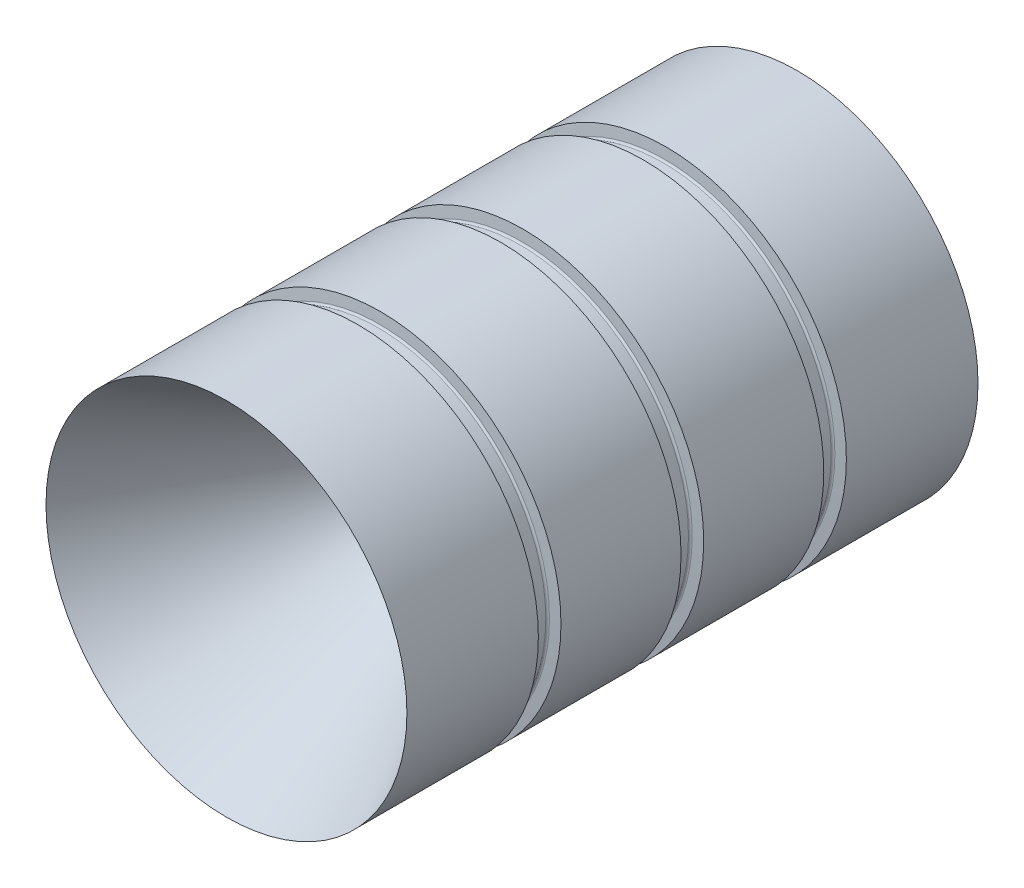
ISO-10303-21;
HEADER;
FILE_DESCRIPTION(('STEP AP214'),'2;1');
FILE_NAME('part.step','',(''),(''),'','','');
FILE_SCHEMA(('AUTOMOTIVE_DESIGN { 1 0 10303 214 1 1 1 1 }'));
ENDSEC;
DATA;
#1=APPLICATION_CONTEXT('core data for automotive mechanical design processes');
#2=APPLICATION_PROTOCOL_DEFINITION('international standard','automotive_design',2000,#1);
#3=PRODUCT_CONTEXT('',#1,'mechanical');
#4=PRODUCT('Part','Part','',(#3));
#5=PRODUCT_RELATED_PRODUCT_CATEGORY('part','',(#4));
#6=PRODUCT_DEFINITION_FORMATION('','',#4);
#7=PRODUCT_DEFINITION_CONTEXT('part definition',#1,'design');
#8=PRODUCT_DEFINITION('design','',#6,#7);
#9=PRODUCT_DEFINITION_SHAPE('','',#8);
#10=(LENGTH_UNIT() NAMED_UNIT(*) SI_UNIT(.MILLI.,.METRE.));
#11=(NAMED_UNIT(*) PLANE_ANGLE_UNIT() SI_UNIT($,.RADIAN.));
#12=(NAMED_UNIT(*) SI_UNIT($,.STERADIAN.) SOLID_ANGLE_UNIT());
#13=UNCERTAINTY_MEASURE_WITH_UNIT(LENGTH_MEASURE(1.E-05),#10,'distance_accuracy_value','');
#14=(GEOMETRIC_REPRESENTATION_CONTEXT(3) GLOBAL_UNCERTAINTY_ASSIGNED_CONTEXT((#13)) GLOBAL_UNIT_ASSIGNED_CONTEXT((#10,
#11,#12)) REPRESENTATION_CONTEXT('',''));
#15=CARTESIAN_POINT('',(0.,0.,0.));
#16=DIRECTION('',(0.,0.,1.));
#17=DIRECTION('',(1.,0.,0.));
#18=AXIS2_PLACEMENT_3D('',#15,#16,#17);
#19=CARTESIAN_POINT('',(0.,0.,0.));
#20=DIRECTION('',(0.,0.,1.));
#21=DIRECTION('',(1.,0.,0.));
#22=AXIS2_PLACEMENT_3D('',#19,#20,#21);
#23=CYLINDRICAL_SURFACE('',#22,41.2749999999944);
#24=CARTESIAN_POINT('',(0.,0.,-359.350121354874));
#25=DIRECTION('',(0.,0.,1.));
#26=DIRECTION('',(1.,0.,0.));
#27=AXIS2_PLACEMENT_3D('',#24,#25,#26);
#28=CIRCLE('',#27,41.2749999999944);
#29=CARTESIAN_POINT('',(41.2749999999944,0.,-359.350121354874));
#30=VERTEX_POINT('',#29);
#31=EDGE_CURVE('E39',#30,#30,#28,.T.);
#32=ORIENTED_EDGE('',*,*,#31,.T.);
#33=EDGE_LOOP('',(#32));
#34=FACE_BOUND('',#33,.T.);
#35=CARTESIAN_POINT('',(0.,0.,-331.883253757861));
#36=DIRECTION('',(0.,0.,-1.));
#37=DIRECTION('',(-1.,0.,0.));
#38=AXIS2_PLACEMENT_3D('',#35,#36,#37);
#39=CIRCLE('',#38,41.2749999999944);
#40=CARTESIAN_POINT('',(-41.2749999999944,0.,-331.883253757861));
#41=VERTEX_POINT('',#40);
#42=EDGE_CURVE('E60',#41,#41,#39,.T.);
#43=ORIENTED_EDGE('',*,*,#42,.T.);
#44=EDGE_LOOP('',(#43));
#45=FACE_BOUND('',#44,.T.);
#46=ADVANCED_FACE('F35',(#34,#45),#23,.T.);
#47=CARTESIAN_POINT('',(0.,0.,-326.711121354874));
#48=DIRECTION('',(0.,0.,1.));
#49=DIRECTION('',(1.,0.,0.));
#50=AXIS2_PLACEMENT_3D('',#47,#48,#49);
#51=CIRCLE('',#50,41.2749999999944);
#52=CARTESIAN_POINT('',(41.2749999999944,0.,-326.711121354874));
#53=VERTEX_POINT('',#52);
#54=EDGE_CURVE('E63',#53,#53,#51,.T.);
#55=ORIENTED_EDGE('',*,*,#54,.T.);
#56=EDGE_LOOP('',(#55));
#57=FACE_BOUND('',#56,.T.);
#58=CARTESIAN_POINT('',(0.,0.,-299.244253757861));
#59=DIRECTION('',(0.,0.,-1.));
#60=DIRECTION('',(-1.,0.,0.));
#61=AXIS2_PLACEMENT_3D('',#58,#59,#60);
#62=CIRCLE('',#61,41.2749999999944);
#63=CARTESIAN_POINT('',(-41.2749999999944,0.,-299.244253757861));
#64=VERTEX_POINT('',#63);
#65=EDGE_CURVE('E52',#64,#64,#62,.T.);
#66=ORIENTED_EDGE('',*,*,#65,.T.);
#67=EDGE_LOOP('',(#66));
#68=FACE_BOUND('',#67,.T.);
#69=ADVANCED_FACE('F196',(#57,#68),#23,.T.);
#70=CARTESIAN_POINT('',(0.,0.,-294.072121354874));
#71=DIRECTION('',(0.,0.,1.));
#72=DIRECTION('',(1.,0.,0.));
#73=AXIS2_PLACEMENT_3D('',#70,#71,#72);
#74=CIRCLE('',#73,41.2749999999944);
#75=CARTESIAN_POINT('',(41.2749999999944,0.,-294.072121354874));
#76=VERTEX_POINT('',#75);
#77=EDGE_CURVE('E55',#76,#76,#74,.T.);
#78=ORIENTED_EDGE('',*,*,#77,.T.);
#79=EDGE_LOOP('',(#78));
#80=FACE_BOUND('',#79,.T.);
#81=CARTESIAN_POINT('',(0.,0.,-264.00861575334));
#82=DIRECTION('',(0.,0.,1.));
#83=DIRECTION('',(1.,0.,0.));
#84=AXIS2_PLACEMENT_3D('',#81,#82,#83);
#85=CIRCLE('',#84,41.2749999999944);
#86=CARTESIAN_POINT('',(41.2749999999944,0.,-264.00861575334));
#87=VERTEX_POINT('',#86);
#88=EDGE_CURVE('E224',#87,#87,#85,.T.);
#89=ORIENTED_EDGE('',*,*,#88,.F.);
#90=EDGE_LOOP('',(#89));
#91=FACE_BOUND('',#90,.T.);
#92=ADVANCED_FACE('F124',(#80,#91),#23,.T.);
#93=CARTESIAN_POINT('',(0.,0.,-315.190684557908));
#94=DIRECTION('',(0.,0.,1.));
#95=DIRECTION('',(1.,0.,0.));
#96=AXIS2_PLACEMENT_3D('',#93,#94,#95);
#97=TOROIDAL_SURFACE('',#96,21.1003335883214,5.83236346593395);
#98=CARTESIAN_POINT('',(0.,0.,-317.157047262264));
#99=DIRECTION('',(0.,0.,1.));
#100=DIRECTION('',(1.,0.,0.));
#101=AXIS2_PLACEMENT_3D('',#98,#99,#100);
#102=CIRCLE('',#101,15.6094428305591);
#103=CARTESIAN_POINT('',(15.6094428305591,0.,-317.157047262264));
#104=VERTEX_POINT('',#103);
#105=EDGE_CURVE('E10',#104,#104,#102,.T.);
#106=ORIENTED_EDGE('',*,*,#105,.F.);
#107=EDGE_LOOP('',(#106));
#108=FACE_BOUND('',#107,.T.);
#109=CARTESIAN_POINT('',(0.,0.,-315.190684557908));
#110=DIRECTION('',(0.,0.,1.));
#111=DIRECTION('',(1.,0.,0.));
#112=AXIS2_PLACEMENT_3D('',#109,#110,#111);
#113=CIRCLE('',#112,15.2679701223874);
#114=CARTESIAN_POINT('',(15.2679701223874,0.,-315.190684557908));
#115=VERTEX_POINT('',#114);
#116=EDGE_CURVE('E59',#115,#115,#113,.T.);
#117=ORIENTED_EDGE('',*,*,#116,.T.);
#118=EDGE_LOOP('',(#117));
#119=FACE_BOUND('',#118,.T.);
#120=ADVANCED_FACE('F37',(#108,#119),#97,.T.);
#121=CARTESIAN_POINT('',(0.,15.6094365633116,-317.157029761452));
#122=CARTESIAN_POINT('',(0.,28.8929861971551,-354.250329010534));
#123=CARTESIAN_POINT('',(0.,34.5678059408336,-394.629031500049));
#124=B_SPLINE_CURVE_WITH_KNOTS('',2,(#121,#122,#123),.UNSPECIFIED.,.F.,.F.,(3,3),(0.,1.),.UNSPECIFIED.);
#125=CARTESIAN_POINT('',(0.,0.,0.));
#126=DIRECTION('',(0.,0.,1.));
#127=AXIS1_PLACEMENT('',#125,#126);
#128=SURFACE_OF_REVOLUTION('',#124,#127);
#129=CARTESIAN_POINT('',(0.,0.,-394.629031500049));
#130=DIRECTION('',(0.,0.,1.));
#131=DIRECTION('',(1.,0.,0.));
#132=AXIS2_PLACEMENT_3D('',#129,#130,#131);
#133=CIRCLE('',#132,34.5678059408336);
#134=CARTESIAN_POINT('',(34.5678059408336,0.,-394.629031500049));
#135=VERTEX_POINT('',#134);
#136=EDGE_CURVE('E43',#135,#135,#133,.T.);
#137=ORIENTED_EDGE('',*,*,#136,.F.);
#138=EDGE_LOOP('',(#137));
#139=FACE_BOUND('',#138,.T.);
#140=ORIENTED_EDGE('',*,*,#105,.T.);
#141=EDGE_LOOP('',(#140));
#142=FACE_BOUND('',#141,.T.);
#143=ADVANCED_FACE('F112',(#139,#142),#128,.T.);
#144=CARTESIAN_POINT('',(0.,0.,-394.629031500049));
#145=DIRECTION('',(0.,0.,-1.));
#146=DIRECTION('',(-1.,0.,0.));
#147=AXIS2_PLACEMENT_3D('',#144,#145,#146);
#148=PLANE('',#147);
#149=ORIENTED_EDGE('',*,*,#136,.T.);
#150=EDGE_LOOP('',(#149));
#151=FACE_BOUND('',#150,.T.);
#152=CARTESIAN_POINT('',(0.,0.,-394.629031500049));
#153=DIRECTION('',(0.,0.,1.));
#154=DIRECTION('',(1.,0.,0.));
#155=AXIS2_PLACEMENT_3D('',#152,#153,#154);
#156=CIRCLE('',#155,41.2749999999944);
#157=CARTESIAN_POINT('',(41.2749999999944,0.,-394.629031500049));
#158=VERTEX_POINT('',#157);
#159=EDGE_CURVE('E48',#158,#158,#156,.T.);
#160=ORIENTED_EDGE('',*,*,#159,.F.);
#161=EDGE_LOOP('',(#160));
#162=FACE_BOUND('',#161,.T.);
#163=ADVANCED_FACE('F115',(#151,#162),#148,.T.);
#164=CARTESIAN_POINT('',(0.,0.,-364.522253757861));
#165=DIRECTION('',(0.,0.,-1.));
#166=DIRECTION('',(-1.,0.,0.));
#167=AXIS2_PLACEMENT_3D('',#164,#165,#166);
#168=CIRCLE('',#167,41.2749999999944);
#169=CARTESIAN_POINT('',(-41.2749999999944,0.,-364.522253757861));
#170=VERTEX_POINT('',#169);
#171=EDGE_CURVE('E67',#170,#170,#168,.T.);
#172=ORIENTED_EDGE('',*,*,#171,.T.);
#173=EDGE_LOOP('',(#172));
#174=FACE_BOUND('',#173,.T.);
#175=ORIENTED_EDGE('',*,*,#159,.T.);
#176=EDGE_LOOP('',(#175));
#177=FACE_BOUND('',#176,.T.);
#178=ADVANCED_FACE('F119',(#174,#177),#23,.T.);
#179=CARTESIAN_POINT('',(0.,0.,-264.00861575334));
#180=DIRECTION('',(0.,0.,1.));
#181=DIRECTION('',(1.,0.,0.));
#182=AXIS2_PLACEMENT_3D('',#179,#180,#181);
#183=CONICAL_SURFACE('',#182,41.2749999999944,0.523598651749106);
#184=CARTESIAN_POINT('',(0.,0.,-309.054125739118));
#185=DIRECTION('',(0.,0.,1.));
#186=DIRECTION('',(1.,0.,0.));
#187=AXIS2_PLACEMENT_3D('',#184,#185,#186);
#188=CIRCLE('',#187,15.2679701223875);
#189=CARTESIAN_POINT('',(15.2679701223875,0.,-309.054125739118));
#190=VERTEX_POINT('',#189);
#191=EDGE_CURVE('E226',#190,#190,#188,.T.);
#192=ORIENTED_EDGE('',*,*,#191,.F.);
#193=EDGE_LOOP('',(#192));
#194=FACE_BOUND('',#193,.T.);
#195=ORIENTED_EDGE('',*,*,#88,.T.);
#196=EDGE_LOOP('',(#195));
#197=FACE_BOUND('',#196,.T.);
#198=ADVANCED_FACE('F123',(#194,#197),#183,.F.);
#199=CARTESIAN_POINT('',(0.,0.,0.));
#200=DIRECTION('',(0.,0.,1.));
#201=DIRECTION('',(1.,0.,0.));
#202=AXIS2_PLACEMENT_3D('',#199,#200,#201);
#203=CYLINDRICAL_SURFACE('',#202,15.2679701223874);
#204=ORIENTED_EDGE('',*,*,#116,.F.);
#205=EDGE_LOOP('',(#204));
#206=FACE_BOUND('',#205,.T.);
#207=ORIENTED_EDGE('',*,*,#191,.T.);
#208=EDGE_LOOP('',(#207));
#209=FACE_BOUND('',#208,.T.);
#210=ADVANCED_FACE('F127',(#206,#209),#203,.F.);
#211=CARTESIAN_POINT('',(0.,0.,-294.064343612686));
#212=DIRECTION('',(0.,0.,1.));
#213=DIRECTION('',(1.,0.,0.));
#214=AXIS2_PLACEMENT_3D('',#211,#212,#213);
#215=CONICAL_SURFACE('',#214,41.3639,1.48352986419519);
#216=CARTESIAN_POINT('',(0.,0.,-294.283287556368));
#217=DIRECTION('',(0.,0.,-1.));
#218=DIRECTION('',(-1.,0.,0.));
#219=AXIS2_PLACEMENT_3D('',#216,#217,#218);
#220=CIRCLE('',#219,38.8613592723487);
#221=CARTESIAN_POINT('',(-38.8613592723487,0.,-294.283287556368));
#222=VERTEX_POINT('',#221);
#223=EDGE_CURVE('E56',#222,#222,#220,.T.);
#224=ORIENTED_EDGE('',*,*,#223,.F.);
#225=EDGE_LOOP('',(#224));
#226=FACE_BOUND('',#225,.T.);
#227=ORIENTED_EDGE('',*,*,#77,.F.);
#228=EDGE_LOOP('',(#227));
#229=FACE_BOUND('',#228,.T.);
#230=ADVANCED_FACE('F131',(#226,#229),#215,.T.);
#231=CARTESIAN_POINT('',(0.,0.,-299.033087556368));
#232=DIRECTION('',(0.,0.,-1.));
#233=DIRECTION('',(-1.,0.,0.));
#234=AXIS2_PLACEMENT_3D('',#231,#232,#233);
#235=CONICAL_SURFACE('',#234,38.8613592723487,1.48352986419517);
#236=CARTESIAN_POINT('',(0.,0.,-299.033087556368));
#237=DIRECTION('',(0.,0.,-1.));
#238=DIRECTION('',(-1.,0.,0.));
#239=AXIS2_PLACEMENT_3D('',#236,#237,#238);
#240=CIRCLE('',#239,38.8613592723487);
#241=CARTESIAN_POINT('',(-38.8613592723487,0.,-299.033087556368));
#242=VERTEX_POINT('',#241);
#243=EDGE_CURVE('E99',#242,#242,#240,.T.);
#244=ORIENTED_EDGE('',*,*,#243,.T.);
#245=EDGE_LOOP('',(#244));
#246=FACE_BOUND('',#245,.T.);
#247=ORIENTED_EDGE('',*,*,#65,.F.);
#248=EDGE_LOOP('',(#247));
#249=FACE_BOUND('',#248,.T.);
#250=ADVANCED_FACE('F137',(#246,#249),#235,.T.);
#251=CARTESIAN_POINT('',(0.,0.,-294.726096099669));
#252=DIRECTION('',(0.,0.,-1.));
#253=DIRECTION('',(-1.,0.,0.));
#254=AXIS2_PLACEMENT_3D('',#251,#252,#253);
#255=TOROIDAL_SURFACE('',#254,38.9001,0.444500000000022);
#256=CARTESIAN_POINT('',(0.,0.,-294.726096099669));
#257=DIRECTION('',(0.,0.,-1.));
#258=DIRECTION('',(-1.,0.,0.));
#259=AXIS2_PLACEMENT_3D('',#256,#257,#258);
#260=CIRCLE('',#259,38.4556);
#261=CARTESIAN_POINT('',(-38.4556,0.,-294.726096099669));
#262=VERTEX_POINT('',#261);
#263=EDGE_CURVE('E66',#262,#262,#260,.T.);
#264=ORIENTED_EDGE('',*,*,#263,.F.);
#265=EDGE_LOOP('',(#264));
#266=FACE_BOUND('',#265,.T.);
#267=ORIENTED_EDGE('',*,*,#223,.T.);
#268=EDGE_LOOP('',(#267));
#269=FACE_BOUND('',#268,.T.);
#270=ADVANCED_FACE('F133',(#266,#269),#255,.F.);
#271=CARTESIAN_POINT('',(0.,0.,-298.590279013066));
#272=DIRECTION('',(0.,0.,-1.));
#273=DIRECTION('',(-1.,0.,0.));
#274=AXIS2_PLACEMENT_3D('',#271,#272,#273);
#275=TOROIDAL_SURFACE('',#274,38.9001,0.44449999999998);
#276=ORIENTED_EDGE('',*,*,#243,.F.);
#277=EDGE_LOOP('',(#276));
#278=FACE_BOUND('',#277,.T.);
#279=CARTESIAN_POINT('',(0.,0.,-298.590279013066));
#280=DIRECTION('',(0.,0.,-1.));
#281=DIRECTION('',(-1.,0.,0.));
#282=AXIS2_PLACEMENT_3D('',#279,#280,#281);
#283=CIRCLE('',#282,38.4556);
#284=CARTESIAN_POINT('',(-38.4556,0.,-298.590279013066));
#285=VERTEX_POINT('',#284);
#286=EDGE_CURVE('E96',#285,#285,#283,.T.);
#287=ORIENTED_EDGE('',*,*,#286,.T.);
#288=EDGE_LOOP('',(#287));
#289=FACE_BOUND('',#288,.T.);
#290=ADVANCED_FACE('F136',(#278,#289),#275,.F.);
#291=CARTESIAN_POINT('',(0.,0.,50.));
#292=DIRECTION('',(0.,0.,-1.));
#293=DIRECTION('',(-1.,0.,0.));
#294=AXIS2_PLACEMENT_3D('',#291,#292,#293);
#295=CYLINDRICAL_SURFACE('',#294,38.4556);
#296=ORIENTED_EDGE('',*,*,#286,.F.);
#297=EDGE_LOOP('',(#296));
#298=FACE_BOUND('',#297,.T.);
#299=ORIENTED_EDGE('',*,*,#263,.T.);
#300=EDGE_LOOP('',(#299));
#301=FACE_BOUND('',#300,.T.);
#302=ADVANCED_FACE('F147',(#298,#301),#295,.T.);
#303=CARTESIAN_POINT('',(0.,0.,-326.703343612686));
#304=DIRECTION('',(0.,0.,1.));
#305=DIRECTION('',(1.,0.,0.));
#306=AXIS2_PLACEMENT_3D('',#303,#304,#305);
#307=CONICAL_SURFACE('',#306,41.3639,1.48352986419517);
#308=CARTESIAN_POINT('',(0.,0.,-326.922287556368));
#309=DIRECTION('',(0.,0.,-1.));
#310=DIRECTION('',(-1.,0.,0.));
#311=AXIS2_PLACEMENT_3D('',#308,#309,#310);
#312=CIRCLE('',#311,38.8613592723487);
#313=CARTESIAN_POINT('',(-38.8613592723487,0.,-326.922287556368));
#314=VERTEX_POINT('',#313);
#315=EDGE_CURVE('E64',#314,#314,#312,.T.);
#316=ORIENTED_EDGE('',*,*,#315,.F.);
#317=EDGE_LOOP('',(#316));
#318=FACE_BOUND('',#317,.T.);
#319=ORIENTED_EDGE('',*,*,#54,.F.);
#320=EDGE_LOOP('',(#319));
#321=FACE_BOUND('',#320,.T.);
#322=ADVANCED_FACE('F151',(#318,#321),#307,.T.);
#323=CARTESIAN_POINT('',(0.,0.,-331.672087556368));
#324=DIRECTION('',(0.,0.,-1.));
#325=DIRECTION('',(-1.,0.,0.));
#326=AXIS2_PLACEMENT_3D('',#323,#324,#325);
#327=CONICAL_SURFACE('',#326,38.8613592723487,1.48352986419517);
#328=CARTESIAN_POINT('',(0.,0.,-331.672087556368));
#329=DIRECTION('',(0.,0.,-1.));
#330=DIRECTION('',(-1.,0.,0.));
#331=AXIS2_PLACEMENT_3D('',#328,#329,#330);
#332=CIRCLE('',#331,38.8613592723487);
#333=CARTESIAN_POINT('',(-38.8613592723487,0.,-331.672087556368));
#334=VERTEX_POINT('',#333);
#335=EDGE_CURVE('E89',#334,#334,#332,.T.);
#336=ORIENTED_EDGE('',*,*,#335,.T.);
#337=EDGE_LOOP('',(#336));
#338=FACE_BOUND('',#337,.T.);
#339=ORIENTED_EDGE('',*,*,#42,.F.);
#340=EDGE_LOOP('',(#339));
#341=FACE_BOUND('',#340,.T.);
#342=ADVANCED_FACE('F157',(#338,#341),#327,.T.);
#343=CARTESIAN_POINT('',(0.,0.,-327.365096099669));
#344=DIRECTION('',(0.,0.,-1.));
#345=DIRECTION('',(-1.,0.,0.));
#346=AXIS2_PLACEMENT_3D('',#343,#344,#345);
#347=TOROIDAL_SURFACE('',#346,38.9001,0.444499999999978);
#348=CARTESIAN_POINT('',(0.,0.,-327.365096099669));
#349=DIRECTION('',(0.,0.,-1.));
#350=DIRECTION('',(-1.,0.,0.));
#351=AXIS2_PLACEMENT_3D('',#348,#349,#350);
#352=CIRCLE('',#351,38.4556);
#353=CARTESIAN_POINT('',(-38.4556,0.,-327.365096099669));
#354=VERTEX_POINT('',#353);
#355=EDGE_CURVE('E73',#354,#354,#352,.T.);
#356=ORIENTED_EDGE('',*,*,#355,.F.);
#357=EDGE_LOOP('',(#356));
#358=FACE_BOUND('',#357,.T.);
#359=ORIENTED_EDGE('',*,*,#315,.T.);
#360=EDGE_LOOP('',(#359));
#361=FACE_BOUND('',#360,.T.);
#362=ADVANCED_FACE('F153',(#358,#361),#347,.F.);
#363=CARTESIAN_POINT('',(0.,0.,-331.229279013066));
#364=DIRECTION('',(0.,0.,-1.));
#365=DIRECTION('',(-1.,0.,0.));
#366=AXIS2_PLACEMENT_3D('',#363,#364,#365);
#367=TOROIDAL_SURFACE('',#366,38.9001,0.444500000000021);
#368=ORIENTED_EDGE('',*,*,#335,.F.);
#369=EDGE_LOOP('',(#368));
#370=FACE_BOUND('',#369,.T.);
#371=CARTESIAN_POINT('',(0.,0.,-331.229279013066));
#372=DIRECTION('',(0.,0.,-1.));
#373=DIRECTION('',(-1.,0.,0.));
#374=AXIS2_PLACEMENT_3D('',#371,#372,#373);
#375=CIRCLE('',#374,38.4556);
#376=CARTESIAN_POINT('',(-38.4556,0.,-331.229279013066));
#377=VERTEX_POINT('',#376);
#378=EDGE_CURVE('E86',#377,#377,#375,.T.);
#379=ORIENTED_EDGE('',*,*,#378,.T.);
#380=EDGE_LOOP('',(#379));
#381=FACE_BOUND('',#380,.T.);
#382=ADVANCED_FACE('F156',(#370,#381),#367,.F.);
#383=CARTESIAN_POINT('',(0.,0.,50.));
#384=DIRECTION('',(0.,0.,-1.));
#385=DIRECTION('',(-1.,0.,0.));
#386=AXIS2_PLACEMENT_3D('',#383,#384,#385);
#387=CYLINDRICAL_SURFACE('',#386,38.4556);
#388=ORIENTED_EDGE('',*,*,#378,.F.);
#389=EDGE_LOOP('',(#388));
#390=FACE_BOUND('',#389,.T.);
#391=ORIENTED_EDGE('',*,*,#355,.T.);
#392=EDGE_LOOP('',(#391));
#393=FACE_BOUND('',#392,.T.);
#394=ADVANCED_FACE('F167',(#390,#393),#387,.T.);
#395=CARTESIAN_POINT('',(0.,0.,-359.342343612686));
#396=DIRECTION('',(0.,0.,1.));
#397=DIRECTION('',(1.,0.,0.));
#398=AXIS2_PLACEMENT_3D('',#395,#396,#397);
#399=CONICAL_SURFACE('',#398,41.3639,1.48352986419519);
#400=CARTESIAN_POINT('',(0.,0.,-359.561287556368));
#401=DIRECTION('',(0.,0.,-1.));
#402=DIRECTION('',(-1.,0.,0.));
#403=AXIS2_PLACEMENT_3D('',#400,#401,#402);
#404=CIRCLE('',#403,38.8613592723487);
#405=CARTESIAN_POINT('',(-38.8613592723487,0.,-359.561287556368));
#406=VERTEX_POINT('',#405);
#407=EDGE_CURVE('E69',#406,#406,#404,.T.);
#408=ORIENTED_EDGE('',*,*,#407,.F.);
#409=EDGE_LOOP('',(#408));
#410=FACE_BOUND('',#409,.T.);
#411=ORIENTED_EDGE('',*,*,#31,.F.);
#412=EDGE_LOOP('',(#411));
#413=FACE_BOUND('',#412,.T.);
#414=ADVANCED_FACE('F171',(#410,#413),#399,.T.);
#415=CARTESIAN_POINT('',(0.,0.,-364.311087556368));
#416=DIRECTION('',(0.,0.,-1.));
#417=DIRECTION('',(-1.,0.,0.));
#418=AXIS2_PLACEMENT_3D('',#415,#416,#417);
#419=CONICAL_SURFACE('',#418,38.8613592723487,1.48352986419515);
#420=CARTESIAN_POINT('',(0.,0.,-364.311087556368));
#421=DIRECTION('',(0.,0.,-1.));
#422=DIRECTION('',(-1.,0.,0.));
#423=AXIS2_PLACEMENT_3D('',#420,#421,#422);
#424=CIRCLE('',#423,38.8613592723487);
#425=CARTESIAN_POINT('',(-38.8613592723487,0.,-364.311087556368));
#426=VERTEX_POINT('',#425);
#427=EDGE_CURVE('E75',#426,#426,#424,.T.);
#428=ORIENTED_EDGE('',*,*,#427,.T.);
#429=EDGE_LOOP('',(#428));
#430=FACE_BOUND('',#429,.T.);
#431=ORIENTED_EDGE('',*,*,#171,.F.);
#432=EDGE_LOOP('',(#431));
#433=FACE_BOUND('',#432,.T.);
#434=ADVANCED_FACE('F177',(#430,#433),#419,.T.);
#435=CARTESIAN_POINT('',(0.,0.,-360.004096099669));
#436=DIRECTION('',(0.,0.,-1.));
#437=DIRECTION('',(-1.,0.,0.));
#438=AXIS2_PLACEMENT_3D('',#435,#436,#437);
#439=TOROIDAL_SURFACE('',#438,38.9001,0.444500000000022);
#440=CARTESIAN_POINT('',(0.,0.,-360.004096099669));
#441=DIRECTION('',(0.,0.,-1.));
#442=DIRECTION('',(-1.,0.,0.));
#443=AXIS2_PLACEMENT_3D('',#440,#441,#442);
#444=CIRCLE('',#443,38.4556);
#445=CARTESIAN_POINT('',(-38.4556,0.,-360.004096099669));
#446=VERTEX_POINT('',#445);
#447=EDGE_CURVE('E383',#446,#446,#444,.T.);
#448=ORIENTED_EDGE('',*,*,#447,.F.);
#449=EDGE_LOOP('',(#448));
#450=FACE_BOUND('',#449,.T.);
#451=ORIENTED_EDGE('',*,*,#407,.T.);
#452=EDGE_LOOP('',(#451));
#453=FACE_BOUND('',#452,.T.);
#454=ADVANCED_FACE('F173',(#450,#453),#439,.F.);
#455=CARTESIAN_POINT('',(0.,0.,-363.868279013066));
#456=DIRECTION('',(0.,0.,-1.));
#457=DIRECTION('',(-1.,0.,0.));
#458=AXIS2_PLACEMENT_3D('',#455,#456,#457);
#459=TOROIDAL_SURFACE('',#458,38.9001,0.44449999999998);
#460=ORIENTED_EDGE('',*,*,#427,.F.);
#461=EDGE_LOOP('',(#460));
#462=FACE_BOUND('',#461,.T.);
#463=CARTESIAN_POINT('',(0.,0.,-363.868279013066));
#464=DIRECTION('',(0.,0.,-1.));
#465=DIRECTION('',(-1.,0.,0.));
#466=AXIS2_PLACEMENT_3D('',#463,#464,#465);
#467=CIRCLE('',#466,38.4556);
#468=CARTESIAN_POINT('',(-38.4556,0.,-363.868279013066));
#469=VERTEX_POINT('',#468);
#470=EDGE_CURVE('E80',#469,#469,#467,.T.);
#471=ORIENTED_EDGE('',*,*,#470,.T.);
#472=EDGE_LOOP('',(#471));
#473=FACE_BOUND('',#472,.T.);
#474=ADVANCED_FACE('F176',(#462,#473),#459,.F.);
#475=CARTESIAN_POINT('',(0.,0.,50.));
#476=DIRECTION('',(0.,0.,-1.));
#477=DIRECTION('',(-1.,0.,0.));
#478=AXIS2_PLACEMENT_3D('',#475,#476,#477);
#479=CYLINDRICAL_SURFACE('',#478,38.4556);
#480=ORIENTED_EDGE('',*,*,#470,.F.);
#481=EDGE_LOOP('',(#480));
#482=FACE_BOUND('',#481,.T.);
#483=ORIENTED_EDGE('',*,*,#447,.T.);
#484=EDGE_LOOP('',(#483));
#485=FACE_BOUND('',#484,.T.);
#486=ADVANCED_FACE('F187',(#482,#485),#479,.T.);
#487=CLOSED_SHELL('',(#46,#69,#92,#120,#143,#163,#178,#198,#210,#230,#250,#270,#290,#302,#322,
#342,#362,#382,#394,#414,#434,#454,#474,#486));
#488=MANIFOLD_SOLID_BREP('B2',#487);
#489=ADVANCED_BREP_SHAPE_REPRESENTATION('',(#18,#488),#14);
#490=SHAPE_DEFINITION_REPRESENTATION(#9,#489);
ENDSEC;
END-ISO-10303-21;
